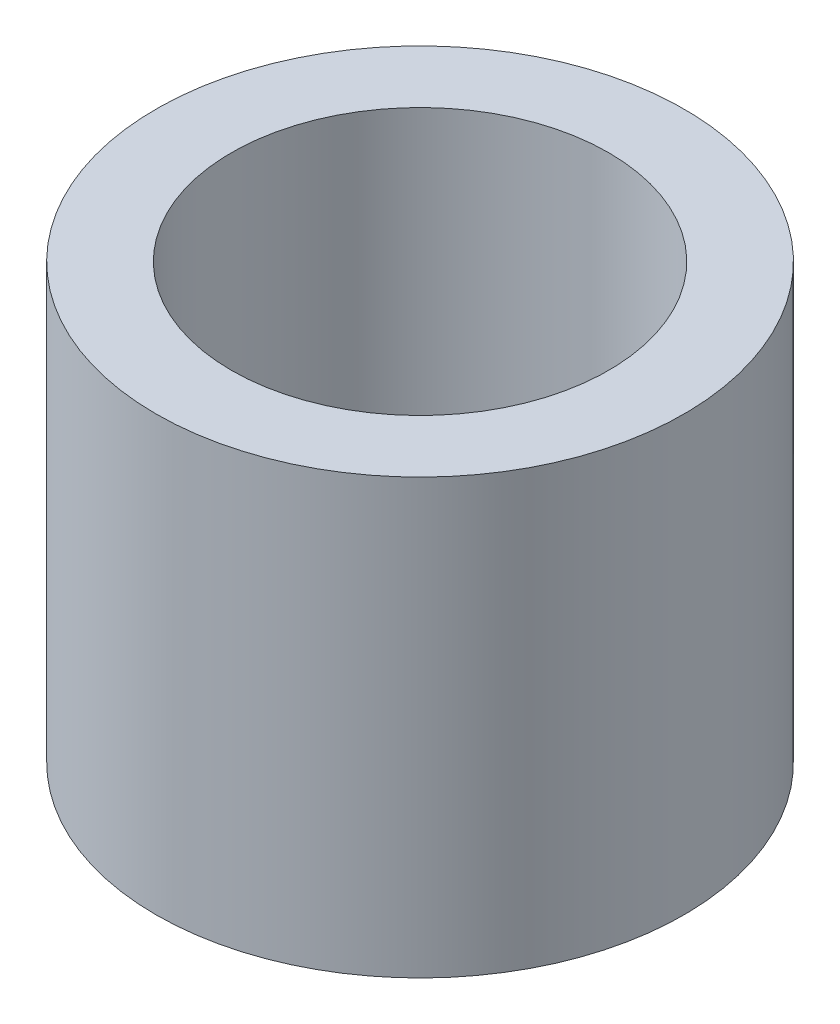
ISO-10303-21;
HEADER;
FILE_DESCRIPTION(('STEP AP214'),'2;1');
FILE_NAME('part.step','',(''),(''),'','','');
FILE_SCHEMA(('AUTOMOTIVE_DESIGN { 1 0 10303 214 1 1 1 1 }'));
ENDSEC;
DATA;
#1=APPLICATION_CONTEXT('core data for automotive mechanical design processes');
#2=APPLICATION_PROTOCOL_DEFINITION('international standard','automotive_design',2000,#1);
#3=PRODUCT_CONTEXT('',#1,'mechanical');
#4=PRODUCT('Part','Part','',(#3));
#5=PRODUCT_RELATED_PRODUCT_CATEGORY('part','',(#4));
#6=PRODUCT_DEFINITION_FORMATION('','',#4);
#7=PRODUCT_DEFINITION_CONTEXT('part definition',#1,'design');
#8=PRODUCT_DEFINITION('design','',#6,#7);
#9=PRODUCT_DEFINITION_SHAPE('','',#8);
#10=(LENGTH_UNIT() NAMED_UNIT(*) SI_UNIT(.MILLI.,.METRE.));
#11=(NAMED_UNIT(*) PLANE_ANGLE_UNIT() SI_UNIT($,.RADIAN.));
#12=(NAMED_UNIT(*) SI_UNIT($,.STERADIAN.) SOLID_ANGLE_UNIT());
#13=UNCERTAINTY_MEASURE_WITH_UNIT(LENGTH_MEASURE(1.E-05),#10,'distance_accuracy_value','');
#14=(GEOMETRIC_REPRESENTATION_CONTEXT(3) GLOBAL_UNCERTAINTY_ASSIGNED_CONTEXT((#13)) GLOBAL_UNIT_ASSIGNED_CONTEXT((#10,
#11,#12)) REPRESENTATION_CONTEXT('',''));
#15=CARTESIAN_POINT('',(0.,0.,0.));
#16=DIRECTION('',(0.,0.,1.));
#17=DIRECTION('',(1.,0.,0.));
#18=AXIS2_PLACEMENT_3D('',#15,#16,#17);
#19=CARTESIAN_POINT('',(0.,73.025,0.));
#20=DIRECTION('',(0.,1.,0.));
#21=DIRECTION('',(0.,0.,1.));
#22=AXIS2_PLACEMENT_3D('',#19,#20,#21);
#23=PLANE('',#22);
#24=CARTESIAN_POINT('',(0.,73.025,0.));
#25=DIRECTION('',(0.,1.,0.));
#26=DIRECTION('',(0.,0.,1.));
#27=AXIS2_PLACEMENT_3D('',#24,#25,#26);
#28=CIRCLE('',#27,44.45);
#29=CARTESIAN_POINT('',(0.,73.025,44.45));
#30=VERTEX_POINT('',#29);
#31=EDGE_CURVE('E10',#30,#30,#28,.T.);
#32=ORIENTED_EDGE('',*,*,#31,.T.);
#33=EDGE_LOOP('',(#32));
#34=FACE_BOUND('',#33,.T.);
#35=CARTESIAN_POINT('',(0.,73.025,0.));
#36=DIRECTION('',(0.,1.,0.));
#37=DIRECTION('',(0.,0.,1.));
#38=AXIS2_PLACEMENT_3D('',#35,#36,#37);
#39=CIRCLE('',#38,31.75);
#40=CARTESIAN_POINT('',(0.,73.025,31.75));
#41=VERTEX_POINT('',#40);
#42=EDGE_CURVE('E50',#41,#41,#39,.T.);
#43=ORIENTED_EDGE('',*,*,#42,.F.);
#44=EDGE_LOOP('',(#43));
#45=FACE_BOUND('',#44,.T.);
#46=ADVANCED_FACE('F37',(#34,#45),#23,.T.);
#47=CARTESIAN_POINT('',(0.,0.,0.));
#48=DIRECTION('',(0.,1.,0.));
#49=DIRECTION('',(0.,0.,1.));
#50=AXIS2_PLACEMENT_3D('',#47,#48,#49);
#51=PLANE('',#50);
#52=CARTESIAN_POINT('',(0.,0.,0.));
#53=DIRECTION('',(0.,1.,0.));
#54=DIRECTION('',(0.,0.,1.));
#55=AXIS2_PLACEMENT_3D('',#52,#53,#54);
#56=CIRCLE('',#55,44.45);
#57=CARTESIAN_POINT('',(0.,0.,44.45));
#58=VERTEX_POINT('',#57);
#59=EDGE_CURVE('E41',#58,#58,#56,.T.);
#60=ORIENTED_EDGE('',*,*,#59,.F.);
#61=EDGE_LOOP('',(#60));
#62=FACE_BOUND('',#61,.T.);
#63=CARTESIAN_POINT('',(0.,0.,0.));
#64=DIRECTION('',(0.,1.,0.));
#65=DIRECTION('',(0.,0.,1.));
#66=AXIS2_PLACEMENT_3D('',#63,#64,#65);
#67=CIRCLE('',#66,31.75);
#68=CARTESIAN_POINT('',(0.,0.,31.75));
#69=VERTEX_POINT('',#68);
#70=EDGE_CURVE('E52',#69,#69,#67,.T.);
#71=ORIENTED_EDGE('',*,*,#70,.T.);
#72=EDGE_LOOP('',(#71));
#73=FACE_BOUND('',#72,.T.);
#74=ADVANCED_FACE('F64',(#62,#73),#51,.F.);
#75=CARTESIAN_POINT('',(0.,73.025,0.));
#76=DIRECTION('',(0.,-1.,0.));
#77=DIRECTION('',(0.,0.,-1.));
#78=AXIS2_PLACEMENT_3D('',#75,#76,#77);
#79=CYLINDRICAL_SURFACE('',#78,44.45);
#80=ORIENTED_EDGE('',*,*,#31,.F.);
#81=EDGE_LOOP('',(#80));
#82=FACE_BOUND('',#81,.T.);
#83=ORIENTED_EDGE('',*,*,#59,.T.);
#84=EDGE_LOOP('',(#83));
#85=FACE_BOUND('',#84,.T.);
#86=ADVANCED_FACE('F39',(#82,#85),#79,.T.);
#87=CARTESIAN_POINT('',(0.,73.025,0.));
#88=DIRECTION('',(0.,-1.,0.));
#89=DIRECTION('',(0.,0.,-1.));
#90=AXIS2_PLACEMENT_3D('',#87,#88,#89);
#91=CYLINDRICAL_SURFACE('',#90,31.75);
#92=ORIENTED_EDGE('',*,*,#42,.T.);
#93=EDGE_LOOP('',(#92));
#94=FACE_BOUND('',#93,.T.);
#95=ORIENTED_EDGE('',*,*,#70,.F.);
#96=EDGE_LOOP('',(#95));
#97=FACE_BOUND('',#96,.T.);
#98=ADVANCED_FACE('F60',(#94,#97),#91,.F.);
#99=CLOSED_SHELL('',(#46,#74,#86,#98));
#100=MANIFOLD_SOLID_BREP('B2',#99);
#101=ADVANCED_BREP_SHAPE_REPRESENTATION('',(#18,#100),#14);
#102=SHAPE_DEFINITION_REPRESENTATION(#9,#101);
ENDSEC;
END-ISO-10303-21;
